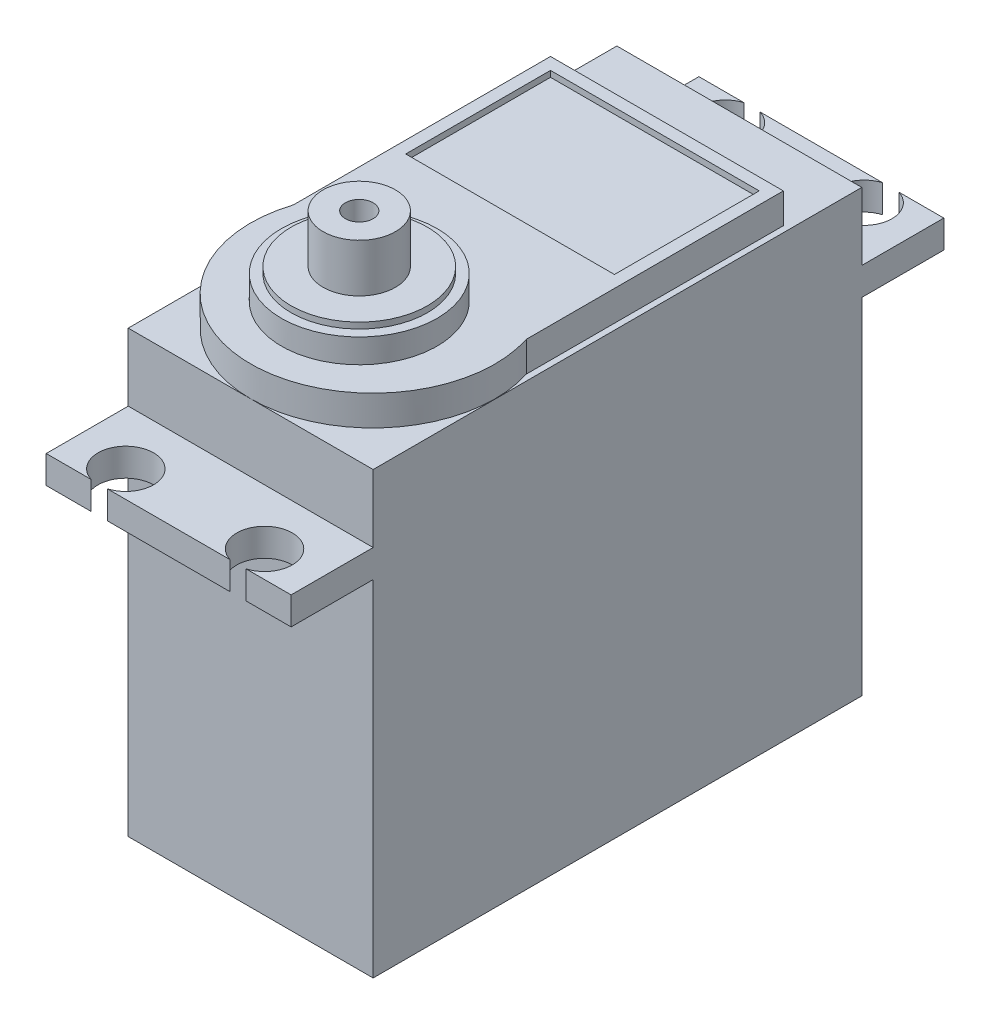
ISO-10303-21;
HEADER;
FILE_DESCRIPTION(('STEP AP214'),'2;1');
FILE_NAME('part.step','',(''),(''),'','','');
FILE_SCHEMA(('AUTOMOTIVE_DESIGN { 1 0 10303 214 1 1 1 1 }'));
ENDSEC;
DATA;
#1=APPLICATION_CONTEXT('core data for automotive mechanical design processes');
#2=APPLICATION_PROTOCOL_DEFINITION('international standard','automotive_design',2000,#1);
#3=PRODUCT_CONTEXT('',#1,'mechanical');
#4=PRODUCT('Part','Part','',(#3));
#5=PRODUCT_RELATED_PRODUCT_CATEGORY('part','',(#4));
#6=PRODUCT_DEFINITION_FORMATION('','',#4);
#7=PRODUCT_DEFINITION_CONTEXT('part definition',#1,'design');
#8=PRODUCT_DEFINITION('design','',#6,#7);
#9=PRODUCT_DEFINITION_SHAPE('','',#8);
#10=(LENGTH_UNIT() NAMED_UNIT(*) SI_UNIT(.MILLI.,.METRE.));
#11=(NAMED_UNIT(*) PLANE_ANGLE_UNIT() SI_UNIT($,.RADIAN.));
#12=(NAMED_UNIT(*) SI_UNIT($,.STERADIAN.) SOLID_ANGLE_UNIT());
#13=UNCERTAINTY_MEASURE_WITH_UNIT(LENGTH_MEASURE(1.E-05),#10,'distance_accuracy_value','');
#14=(GEOMETRIC_REPRESENTATION_CONTEXT(3) GLOBAL_UNCERTAINTY_ASSIGNED_CONTEXT((#13)) GLOBAL_UNIT_ASSIGNED_CONTEXT((#10,
#11,#12)) REPRESENTATION_CONTEXT('',''));
#15=CARTESIAN_POINT('',(0.,0.,0.));
#16=DIRECTION('',(0.,0.,1.));
#17=DIRECTION('',(1.,0.,0.));
#18=AXIS2_PLACEMENT_3D('',#15,#16,#17);
#19=CARTESIAN_POINT('',(-10.15,30.9,-27.05));
#20=DIRECTION('',(0.,-1.,0.));
#21=DIRECTION('',(0.,0.,-1.));
#22=AXIS2_PLACEMENT_3D('',#19,#20,#21);
#23=PLANE('',#22);
#24=DIRECTION('',(1.,0.,0.));
#25=VECTOR('',#24,1.);
#26=CARTESIAN_POINT('',(-10.15,30.9,-27.05));
#27=LINE('',#26,#25);
#28=CARTESIAN_POINT('',(-5.07917960675002,30.9,-27.05));
#29=VERTEX_POINT('',#28);
#30=CARTESIAN_POINT('',(5.07917960675007,30.9,-27.05));
#31=VERTEX_POINT('',#30);
#32=EDGE_CURVE('E351',#29,#31,#27,.T.);
#33=ORIENTED_EDGE('',*,*,#32,.F.);
#34=CARTESIAN_POINT('',(-5.74999999999999,30.9,-24.85));
#35=DIRECTION('',(0.,-1.,0.));
#36=DIRECTION('',(0.,0.,-1.));
#37=AXIS2_PLACEMENT_3D('',#34,#35,#36);
#38=CIRCLE('',#37,2.3);
#39=CARTESIAN_POINT('',(-6.42082039324996,30.9,-27.05));
#40=VERTEX_POINT('',#39);
#41=EDGE_CURVE('E315',#40,#29,#38,.F.);
#42=ORIENTED_EDGE('',*,*,#41,.F.);
#43=CARTESIAN_POINT('',(-10.15,30.9,-27.05));
#44=VERTEX_POINT('',#43);
#45=EDGE_CURVE('E347',#44,#40,#27,.T.);
#46=ORIENTED_EDGE('',*,*,#45,.F.);
#47=DIRECTION('',(0.,0.,1.));
#48=VECTOR('',#47,1.);
#49=CARTESIAN_POINT('',(-10.15,30.9,-27.05));
#50=LINE('',#49,#48);
#51=CARTESIAN_POINT('',(-10.15,30.9,-20.25));
#52=VERTEX_POINT('',#51);
#53=EDGE_CURVE('E356',#44,#52,#50,.T.);
#54=ORIENTED_EDGE('',*,*,#53,.T.);
#55=DIRECTION('',(1.,0.,0.));
#56=VECTOR('',#55,1.);
#57=CARTESIAN_POINT('',(-10.15,30.9,-20.25));
#58=LINE('',#57,#56);
#59=CARTESIAN_POINT('',(10.15,30.9,-20.25));
#60=VERTEX_POINT('',#59);
#61=EDGE_CURVE('E339',#52,#60,#58,.T.);
#62=ORIENTED_EDGE('',*,*,#61,.T.);
#63=DIRECTION('',(0.,0.,1.));
#64=VECTOR('',#63,1.);
#65=CARTESIAN_POINT('',(10.15,30.9,-27.05));
#66=LINE('',#65,#64);
#67=CARTESIAN_POINT('',(10.15,30.9,-27.05));
#68=VERTEX_POINT('',#67);
#69=EDGE_CURVE('E360',#68,#60,#66,.T.);
#70=ORIENTED_EDGE('',*,*,#69,.F.);
#71=CARTESIAN_POINT('',(6.42082039324993,30.9,-27.05));
#72=VERTEX_POINT('',#71);
#73=EDGE_CURVE('E346',#72,#68,#27,.T.);
#74=ORIENTED_EDGE('',*,*,#73,.F.);
#75=CARTESIAN_POINT('',(5.75,30.9,-24.85));
#76=DIRECTION('',(0.,-1.,0.));
#77=DIRECTION('',(0.,0.,-1.));
#78=AXIS2_PLACEMENT_3D('',#75,#76,#77);
#79=CIRCLE('',#78,2.3);
#80=EDGE_CURVE('E322',#72,#31,#79,.T.);
#81=ORIENTED_EDGE('',*,*,#80,.T.);
#82=EDGE_LOOP('',(#33,#42,#46,#54,#62,#70,#74,#81));
#83=FACE_BOUND('',#82,.T.);
#84=ADVANCED_FACE('F38',(#83),#23,.F.);
#85=CARTESIAN_POINT('',(10.15,28.6,-27.05));
#86=DIRECTION('',(0.,1.,0.));
#87=DIRECTION('',(0.,0.,1.));
#88=AXIS2_PLACEMENT_3D('',#85,#86,#87);
#89=PLANE('',#88);
#90=DIRECTION('',(-1.,0.,0.));
#91=VECTOR('',#90,1.);
#92=CARTESIAN_POINT('',(10.15,28.6,-27.05));
#93=LINE('',#92,#91);
#94=CARTESIAN_POINT('',(-6.42082039324996,28.6,-27.05));
#95=VERTEX_POINT('',#94);
#96=CARTESIAN_POINT('',(-10.15,28.6,-27.05));
#97=VERTEX_POINT('',#96);
#98=EDGE_CURVE('E338',#95,#97,#93,.T.);
#99=ORIENTED_EDGE('',*,*,#98,.F.);
#100=CARTESIAN_POINT('',(-5.74999999999999,28.6,-24.85));
#101=DIRECTION('',(0.,1.,0.));
#102=DIRECTION('',(0.,0.,1.));
#103=AXIS2_PLACEMENT_3D('',#100,#101,#102);
#104=CIRCLE('',#103,2.3);
#105=CARTESIAN_POINT('',(-5.07917960675002,28.6,-27.05));
#106=VERTEX_POINT('',#105);
#107=EDGE_CURVE('E319',#106,#95,#104,.F.);
#108=ORIENTED_EDGE('',*,*,#107,.F.);
#109=CARTESIAN_POINT('',(5.07917960675007,28.6,-27.05));
#110=VERTEX_POINT('',#109);
#111=EDGE_CURVE('E344',#110,#106,#93,.T.);
#112=ORIENTED_EDGE('',*,*,#111,.F.);
#113=CARTESIAN_POINT('',(5.75,28.6,-24.85));
#114=DIRECTION('',(0.,1.,0.));
#115=DIRECTION('',(0.,0.,1.));
#116=AXIS2_PLACEMENT_3D('',#113,#114,#115);
#117=CIRCLE('',#116,2.3);
#118=CARTESIAN_POINT('',(6.42082039324993,28.6,-27.05));
#119=VERTEX_POINT('',#118);
#120=EDGE_CURVE('E307',#110,#119,#117,.T.);
#121=ORIENTED_EDGE('',*,*,#120,.T.);
#122=CARTESIAN_POINT('',(10.15,28.6,-27.05));
#123=VERTEX_POINT('',#122);
#124=EDGE_CURVE('E340',#123,#119,#93,.T.);
#125=ORIENTED_EDGE('',*,*,#124,.F.);
#126=DIRECTION('',(0.,0.,1.));
#127=VECTOR('',#126,1.);
#128=CARTESIAN_POINT('',(10.15,28.6,-27.05));
#129=LINE('',#128,#127);
#130=CARTESIAN_POINT('',(10.15,28.6,-20.25));
#131=VERTEX_POINT('',#130);
#132=EDGE_CURVE('E363',#123,#131,#129,.T.);
#133=ORIENTED_EDGE('',*,*,#132,.T.);
#134=DIRECTION('',(-1.,0.,0.));
#135=VECTOR('',#134,1.);
#136=CARTESIAN_POINT('',(10.15,28.6,-20.25));
#137=LINE('',#136,#135);
#138=CARTESIAN_POINT('',(-10.15,28.6,-20.25));
#139=VERTEX_POINT('',#138);
#140=EDGE_CURVE('E317',#131,#139,#137,.T.);
#141=ORIENTED_EDGE('',*,*,#140,.T.);
#142=DIRECTION('',(0.,0.,1.));
#143=VECTOR('',#142,1.);
#144=CARTESIAN_POINT('',(-10.15,28.6,-27.05));
#145=LINE('',#144,#143);
#146=EDGE_CURVE('E350',#97,#139,#145,.T.);
#147=ORIENTED_EDGE('',*,*,#146,.F.);
#148=EDGE_LOOP('',(#99,#108,#112,#121,#125,#133,#141,#147));
#149=FACE_BOUND('',#148,.T.);
#150=ADVANCED_FACE('F478',(#149),#89,.F.);
#151=CARTESIAN_POINT('',(0.,0.,-27.05));
#152=DIRECTION('',(0.,0.,1.));
#153=DIRECTION('',(-1.,0.,0.));
#154=AXIS2_PLACEMENT_3D('',#151,#152,#153);
#155=PLANE('',#154);
#156=ORIENTED_EDGE('',*,*,#111,.T.);
#157=DIRECTION('',(0.,1.,0.));
#158=VECTOR('',#157,1.);
#159=CARTESIAN_POINT('',(-5.07917960675002,-0.00199999999999853,-27.05));
#160=LINE('',#159,#158);
#161=EDGE_CURVE('E321',#106,#29,#160,.T.);
#162=ORIENTED_EDGE('',*,*,#161,.T.);
#163=ORIENTED_EDGE('',*,*,#32,.T.);
#164=DIRECTION('',(0.,1.,0.));
#165=VECTOR('',#164,1.);
#166=CARTESIAN_POINT('',(5.07917960675007,-0.00199999999999853,-27.05));
#167=LINE('',#166,#165);
#168=EDGE_CURVE('E331',#110,#31,#167,.T.);
#169=ORIENTED_EDGE('',*,*,#168,.F.);
#170=EDGE_LOOP('',(#156,#162,#163,#169));
#171=FACE_BOUND('',#170,.T.);
#172=ADVANCED_FACE('F543',(#171),#155,.F.);
#173=DIRECTION('',(0.,1.,0.));
#174=VECTOR('',#173,1.);
#175=CARTESIAN_POINT('',(6.42082039324993,-0.00199999999999853,-27.05));
#176=LINE('',#175,#174);
#177=EDGE_CURVE('E328',#119,#72,#176,.T.);
#178=ORIENTED_EDGE('',*,*,#177,.T.);
#179=ORIENTED_EDGE('',*,*,#73,.T.);
#180=DIRECTION('',(0.,-1.,0.));
#181=VECTOR('',#180,1.);
#182=CARTESIAN_POINT('',(10.15,30.9,-27.05));
#183=LINE('',#182,#181);
#184=EDGE_CURVE('E343',#68,#123,#183,.T.);
#185=ORIENTED_EDGE('',*,*,#184,.T.);
#186=ORIENTED_EDGE('',*,*,#124,.T.);
#187=EDGE_LOOP('',(#178,#179,#185,#186));
#188=FACE_BOUND('',#187,.T.);
#189=ADVANCED_FACE('F483',(#188),#155,.F.);
#190=ORIENTED_EDGE('',*,*,#45,.T.);
#191=DIRECTION('',(0.,1.,0.));
#192=VECTOR('',#191,1.);
#193=CARTESIAN_POINT('',(-6.42082039324996,-0.00199999999999853,-27.05));
#194=LINE('',#193,#192);
#195=EDGE_CURVE('E318',#95,#40,#194,.T.);
#196=ORIENTED_EDGE('',*,*,#195,.F.);
#197=ORIENTED_EDGE('',*,*,#98,.T.);
#198=DIRECTION('',(0.,1.,0.));
#199=VECTOR('',#198,1.);
#200=CARTESIAN_POINT('',(-10.15,28.6,-27.05));
#201=LINE('',#200,#199);
#202=EDGE_CURVE('E335',#97,#44,#201,.T.);
#203=ORIENTED_EDGE('',*,*,#202,.T.);
#204=EDGE_LOOP('',(#190,#196,#197,#203));
#205=FACE_BOUND('',#204,.T.);
#206=ADVANCED_FACE('F809',(#205),#155,.F.);
#207=CARTESIAN_POINT('',(-10.15,36.5,-20.25));
#208=DIRECTION('',(0.,0.,1.));
#209=DIRECTION('',(1.,0.,0.));
#210=AXIS2_PLACEMENT_3D('',#207,#208,#209);
#211=PLANE('',#210);
#212=ORIENTED_EDGE('',*,*,#140,.F.);
#213=DIRECTION('',(0.,-1.,0.));
#214=VECTOR('',#213,1.);
#215=CARTESIAN_POINT('',(10.15,36.5,-20.25));
#216=LINE('',#215,#214);
#217=CARTESIAN_POINT('',(10.15,0.,-20.25));
#218=VERTEX_POINT('',#217);
#219=EDGE_CURVE('E451',#131,#218,#216,.T.);
#220=ORIENTED_EDGE('',*,*,#219,.T.);
#221=DIRECTION('',(-1.,0.,0.));
#222=VECTOR('',#221,1.);
#223=CARTESIAN_POINT('',(-10.15,0.,-20.25));
#224=LINE('',#223,#222);
#225=CARTESIAN_POINT('',(-10.15,0.,-20.25));
#226=VERTEX_POINT('',#225);
#227=EDGE_CURVE('E433',#218,#226,#224,.T.);
#228=ORIENTED_EDGE('',*,*,#227,.T.);
#229=DIRECTION('',(0.,-1.,0.));
#230=VECTOR('',#229,1.);
#231=CARTESIAN_POINT('',(-10.15,36.5,-20.25));
#232=LINE('',#231,#230);
#233=EDGE_CURVE('E448',#139,#226,#232,.T.);
#234=ORIENTED_EDGE('',*,*,#233,.F.);
#235=EDGE_LOOP('',(#212,#220,#228,#234));
#236=FACE_BOUND('',#235,.T.);
#237=ADVANCED_FACE('F458',(#236),#211,.F.);
#238=ORIENTED_EDGE('',*,*,#61,.F.);
#239=CARTESIAN_POINT('',(-10.15,36.5,-20.25));
#240=VERTEX_POINT('',#239);
#241=EDGE_CURVE('E449',#240,#52,#232,.T.);
#242=ORIENTED_EDGE('',*,*,#241,.F.);
#243=DIRECTION('',(-1.,0.,0.));
#244=VECTOR('',#243,1.);
#245=CARTESIAN_POINT('',(-10.15,36.5,-20.25));
#246=LINE('',#245,#244);
#247=CARTESIAN_POINT('',(10.15,36.5,-20.25));
#248=VERTEX_POINT('',#247);
#249=EDGE_CURVE('E421',#248,#240,#246,.T.);
#250=ORIENTED_EDGE('',*,*,#249,.F.);
#251=EDGE_CURVE('E452',#248,#60,#216,.T.);
#252=ORIENTED_EDGE('',*,*,#251,.T.);
#253=EDGE_LOOP('',(#238,#242,#250,#252));
#254=FACE_BOUND('',#253,.T.);
#255=ADVANCED_FACE('F489',(#254),#211,.F.);
#256=CARTESIAN_POINT('',(10.15,28.6,27.05));
#257=DIRECTION('',(0.,-1.,0.));
#258=DIRECTION('',(0.,0.,-1.));
#259=AXIS2_PLACEMENT_3D('',#256,#257,#258);
#260=PLANE('',#259);
#261=DIRECTION('',(-1.,0.,0.));
#262=VECTOR('',#261,1.);
#263=CARTESIAN_POINT('',(10.15,28.6,27.05));
#264=LINE('',#263,#262);
#265=CARTESIAN_POINT('',(5.07917960675007,28.6,27.05));
#266=VERTEX_POINT('',#265);
#267=CARTESIAN_POINT('',(-5.07917960675003,28.6,27.05));
#268=VERTEX_POINT('',#267);
#269=EDGE_CURVE('E405',#266,#268,#264,.T.);
#270=ORIENTED_EDGE('',*,*,#269,.T.);
#271=CARTESIAN_POINT('',(-5.74999999999999,28.6,24.85));
#272=DIRECTION('',(0.,-1.,0.));
#273=DIRECTION('',(0.,0.,-1.));
#274=AXIS2_PLACEMENT_3D('',#271,#272,#273);
#275=CIRCLE('',#274,2.3);
#276=CARTESIAN_POINT('',(-6.42082039324996,28.6,27.05));
#277=VERTEX_POINT('',#276);
#278=EDGE_CURVE('E373',#277,#268,#275,.T.);
#279=ORIENTED_EDGE('',*,*,#278,.F.);
#280=CARTESIAN_POINT('',(-10.15,28.6,27.05));
#281=VERTEX_POINT('',#280);
#282=EDGE_CURVE('E400',#277,#281,#264,.T.);
#283=ORIENTED_EDGE('',*,*,#282,.T.);
#284=DIRECTION('',(0.,0.,-1.));
#285=VECTOR('',#284,1.);
#286=CARTESIAN_POINT('',(-10.15,28.6,27.05));
#287=LINE('',#286,#285);
#288=CARTESIAN_POINT('',(-10.15,28.6,20.25));
#289=VERTEX_POINT('',#288);
#290=EDGE_CURVE('E410',#281,#289,#287,.T.);
#291=ORIENTED_EDGE('',*,*,#290,.T.);
#292=DIRECTION('',(-1.,0.,0.));
#293=VECTOR('',#292,1.);
#294=CARTESIAN_POINT('',(10.15,28.6,20.25));
#295=LINE('',#294,#293);
#296=CARTESIAN_POINT('',(10.15,28.6,20.25));
#297=VERTEX_POINT('',#296);
#298=EDGE_CURVE('E392',#297,#289,#295,.T.);
#299=ORIENTED_EDGE('',*,*,#298,.F.);
#300=DIRECTION('',(0.,0.,-1.));
#301=VECTOR('',#300,1.);
#302=CARTESIAN_POINT('',(10.15,28.6,27.05));
#303=LINE('',#302,#301);
#304=CARTESIAN_POINT('',(10.15,28.6,27.05));
#305=VERTEX_POINT('',#304);
#306=EDGE_CURVE('E413',#305,#297,#303,.T.);
#307=ORIENTED_EDGE('',*,*,#306,.F.);
#308=CARTESIAN_POINT('',(6.42082039324993,28.6,27.05));
#309=VERTEX_POINT('',#308);
#310=EDGE_CURVE('E401',#305,#309,#264,.T.);
#311=ORIENTED_EDGE('',*,*,#310,.T.);
#312=CARTESIAN_POINT('',(5.75,28.6,24.85));
#313=DIRECTION('',(0.,-1.,0.));
#314=DIRECTION('',(0.,0.,-1.));
#315=AXIS2_PLACEMENT_3D('',#312,#313,#314);
#316=CIRCLE('',#315,2.3);
#317=EDGE_CURVE('E359',#309,#266,#316,.F.);
#318=ORIENTED_EDGE('',*,*,#317,.T.);
#319=EDGE_LOOP('',(#270,#279,#283,#291,#299,#307,#311,#318));
#320=FACE_BOUND('',#319,.T.);
#321=ADVANCED_FACE('F520',(#320),#260,.T.);
#322=CARTESIAN_POINT('',(-10.15,30.9,27.05));
#323=DIRECTION('',(0.,1.,0.));
#324=DIRECTION('',(0.,0.,1.));
#325=AXIS2_PLACEMENT_3D('',#322,#323,#324);
#326=PLANE('',#325);
#327=DIRECTION('',(1.,0.,0.));
#328=VECTOR('',#327,1.);
#329=CARTESIAN_POINT('',(-10.15,30.9,27.05));
#330=LINE('',#329,#328);
#331=CARTESIAN_POINT('',(-10.15,30.9,27.05));
#332=VERTEX_POINT('',#331);
#333=CARTESIAN_POINT('',(-6.42082039324996,30.9,27.05));
#334=VERTEX_POINT('',#333);
#335=EDGE_CURVE('E393',#332,#334,#330,.T.);
#336=ORIENTED_EDGE('',*,*,#335,.T.);
#337=CARTESIAN_POINT('',(-5.74999999999999,30.9,24.85));
#338=DIRECTION('',(0.,1.,0.));
#339=DIRECTION('',(0.,0.,1.));
#340=AXIS2_PLACEMENT_3D('',#337,#338,#339);
#341=CIRCLE('',#340,2.3);
#342=CARTESIAN_POINT('',(-5.07917960675002,30.9,27.05));
#343=VERTEX_POINT('',#342);
#344=EDGE_CURVE('E368',#334,#343,#341,.F.);
#345=ORIENTED_EDGE('',*,*,#344,.T.);
#346=CARTESIAN_POINT('',(5.07917960675007,30.9,27.05));
#347=VERTEX_POINT('',#346);
#348=EDGE_CURVE('E397',#343,#347,#330,.T.);
#349=ORIENTED_EDGE('',*,*,#348,.T.);
#350=CARTESIAN_POINT('',(5.75,30.9,24.85));
#351=DIRECTION('',(0.,1.,0.));
#352=DIRECTION('',(0.,0.,1.));
#353=AXIS2_PLACEMENT_3D('',#350,#351,#352);
#354=CIRCLE('',#353,2.3);
#355=CARTESIAN_POINT('',(6.42082039324993,30.9,27.05));
#356=VERTEX_POINT('',#355);
#357=EDGE_CURVE('E376',#356,#347,#354,.T.);
#358=ORIENTED_EDGE('',*,*,#357,.F.);
#359=CARTESIAN_POINT('',(10.15,30.9,27.05));
#360=VERTEX_POINT('',#359);
#361=EDGE_CURVE('E391',#356,#360,#330,.T.);
#362=ORIENTED_EDGE('',*,*,#361,.T.);
#363=DIRECTION('',(0.,0.,-1.));
#364=VECTOR('',#363,1.);
#365=CARTESIAN_POINT('',(10.15,30.9,27.05));
#366=LINE('',#365,#364);
#367=CARTESIAN_POINT('',(10.15,30.9,20.25));
#368=VERTEX_POINT('',#367);
#369=EDGE_CURVE('E415',#360,#368,#366,.T.);
#370=ORIENTED_EDGE('',*,*,#369,.T.);
#371=DIRECTION('',(1.,0.,0.));
#372=VECTOR('',#371,1.);
#373=CARTESIAN_POINT('',(-10.15,30.9,20.25));
#374=LINE('',#373,#372);
#375=CARTESIAN_POINT('',(-10.15,30.9,20.25));
#376=VERTEX_POINT('',#375);
#377=EDGE_CURVE('E371',#376,#368,#374,.T.);
#378=ORIENTED_EDGE('',*,*,#377,.F.);
#379=DIRECTION('',(0.,0.,-1.));
#380=VECTOR('',#379,1.);
#381=CARTESIAN_POINT('',(-10.15,30.9,27.05));
#382=LINE('',#381,#380);
#383=EDGE_CURVE('E404',#332,#376,#382,.T.);
#384=ORIENTED_EDGE('',*,*,#383,.F.);
#385=EDGE_LOOP('',(#336,#345,#349,#358,#362,#370,#378,#384));
#386=FACE_BOUND('',#385,.T.);
#387=ADVANCED_FACE('F504',(#386),#326,.T.);
#388=CARTESIAN_POINT('',(0.,0.,27.05));
#389=DIRECTION('',(0.,0.,-1.));
#390=DIRECTION('',(-1.,0.,0.));
#391=AXIS2_PLACEMENT_3D('',#388,#389,#390);
#392=PLANE('',#391);
#393=DIRECTION('',(0.,1.,0.));
#394=VECTOR('',#393,1.);
#395=CARTESIAN_POINT('',(-6.42082039324996,-0.00199999999999853,27.05));
#396=LINE('',#395,#394);
#397=EDGE_CURVE('E375',#277,#334,#396,.T.);
#398=ORIENTED_EDGE('',*,*,#397,.T.);
#399=ORIENTED_EDGE('',*,*,#335,.F.);
#400=DIRECTION('',(0.,1.,0.));
#401=VECTOR('',#400,1.);
#402=CARTESIAN_POINT('',(-10.15,28.6,27.05));
#403=LINE('',#402,#401);
#404=EDGE_CURVE('E388',#281,#332,#403,.T.);
#405=ORIENTED_EDGE('',*,*,#404,.F.);
#406=ORIENTED_EDGE('',*,*,#282,.F.);
#407=EDGE_LOOP('',(#398,#399,#405,#406));
#408=FACE_BOUND('',#407,.T.);
#409=ADVANCED_FACE('F526',(#408),#392,.F.);
#410=DIRECTION('',(0.,1.,0.));
#411=VECTOR('',#410,1.);
#412=CARTESIAN_POINT('',(-5.07917960675002,-0.00199999999999853,27.05));
#413=LINE('',#412,#411);
#414=EDGE_CURVE('E372',#268,#343,#413,.T.);
#415=ORIENTED_EDGE('',*,*,#414,.F.);
#416=ORIENTED_EDGE('',*,*,#269,.F.);
#417=DIRECTION('',(0.,1.,0.));
#418=VECTOR('',#417,1.);
#419=CARTESIAN_POINT('',(5.07917960675007,-0.00199999999999853,27.05));
#420=LINE('',#419,#418);
#421=EDGE_CURVE('E381',#266,#347,#420,.T.);
#422=ORIENTED_EDGE('',*,*,#421,.T.);
#423=ORIENTED_EDGE('',*,*,#348,.F.);
#424=EDGE_LOOP('',(#415,#416,#422,#423));
#425=FACE_BOUND('',#424,.T.);
#426=ADVANCED_FACE('F514',(#425),#392,.F.);
#427=CARTESIAN_POINT('',(-10.15,36.5,20.25));
#428=DIRECTION('',(0.,0.,-1.));
#429=DIRECTION('',(-1.,0.,0.));
#430=AXIS2_PLACEMENT_3D('',#427,#428,#429);
#431=PLANE('',#430);
#432=DIRECTION('',(0.,-1.,0.));
#433=VECTOR('',#432,1.);
#434=CARTESIAN_POINT('',(-10.15,36.5,20.25));
#435=LINE('',#434,#433);
#436=CARTESIAN_POINT('',(-10.15,36.5,20.25));
#437=VERTEX_POINT('',#436);
#438=EDGE_CURVE('E445',#437,#376,#435,.T.);
#439=ORIENTED_EDGE('',*,*,#438,.T.);
#440=ORIENTED_EDGE('',*,*,#377,.T.);
#441=DIRECTION('',(0.,-1.,0.));
#442=VECTOR('',#441,1.);
#443=CARTESIAN_POINT('',(10.15,36.5,20.25));
#444=LINE('',#443,#442);
#445=CARTESIAN_POINT('',(10.15,36.5,20.25));
#446=VERTEX_POINT('',#445);
#447=EDGE_CURVE('E441',#446,#368,#444,.T.);
#448=ORIENTED_EDGE('',*,*,#447,.F.);
#449=DIRECTION('',(1.,0.,0.));
#450=VECTOR('',#449,1.);
#451=CARTESIAN_POINT('',(-10.15,36.5,20.25));
#452=LINE('',#451,#450);
#453=CARTESIAN_POINT('',(0.,36.5,20.25));
#454=VERTEX_POINT('',#453);
#455=EDGE_CURVE('E426',#454,#446,#452,.T.);
#456=ORIENTED_EDGE('',*,*,#455,.F.);
#457=EDGE_CURVE('E427',#437,#454,#452,.T.);
#458=ORIENTED_EDGE('',*,*,#457,.F.);
#459=EDGE_LOOP('',(#439,#440,#448,#456,#458));
#460=FACE_BOUND('',#459,.T.);
#461=ADVANCED_FACE('F501',(#460),#431,.F.);
#462=CARTESIAN_POINT('',(10.15,36.5,20.25));
#463=DIRECTION('',(-1.,0.,0.));
#464=DIRECTION('',(0.,0.,1.));
#465=AXIS2_PLACEMENT_3D('',#462,#463,#464);
#466=PLANE('',#465);
#467=DIRECTION('',(0.,0.,-1.));
#468=VECTOR('',#467,1.);
#469=CARTESIAN_POINT('',(10.15,0.,20.25));
#470=LINE('',#469,#468);
#471=CARTESIAN_POINT('',(10.15,0.,20.25));
#472=VERTEX_POINT('',#471);
#473=EDGE_CURVE('E412',#472,#218,#470,.T.);
#474=ORIENTED_EDGE('',*,*,#473,.T.);
#475=ORIENTED_EDGE('',*,*,#219,.F.);
#476=ORIENTED_EDGE('',*,*,#132,.F.);
#477=ORIENTED_EDGE('',*,*,#184,.F.);
#478=ORIENTED_EDGE('',*,*,#69,.T.);
#479=ORIENTED_EDGE('',*,*,#251,.F.);
#480=DIRECTION('',(0.,0.,-1.));
#481=VECTOR('',#480,1.);
#482=CARTESIAN_POINT('',(10.15,36.5,20.25));
#483=LINE('',#482,#481);
#484=EDGE_CURVE('E418',#446,#248,#483,.T.);
#485=ORIENTED_EDGE('',*,*,#484,.F.);
#486=ORIENTED_EDGE('',*,*,#447,.T.);
#487=ORIENTED_EDGE('',*,*,#369,.F.);
#488=DIRECTION('',(0.,-1.,0.));
#489=VECTOR('',#488,1.);
#490=CARTESIAN_POINT('',(10.15,30.9,27.05));
#491=LINE('',#490,#489);
#492=EDGE_CURVE('E396',#360,#305,#491,.T.);
#493=ORIENTED_EDGE('',*,*,#492,.T.);
#494=ORIENTED_EDGE('',*,*,#306,.T.);
#495=EDGE_CURVE('E430',#297,#472,#444,.T.);
#496=ORIENTED_EDGE('',*,*,#495,.T.);
#497=EDGE_LOOP('',(#474,#475,#476,#477,#478,#479,#485,#486,#487,#493,#494,#496));
#498=FACE_BOUND('',#497,.T.);
#499=ADVANCED_FACE('F40',(#498),#466,.F.);
#500=CARTESIAN_POINT('',(-10.15,36.5,20.25));
#501=DIRECTION('',(1.,0.,0.));
#502=DIRECTION('',(0.,0.,-1.));
#503=AXIS2_PLACEMENT_3D('',#500,#501,#502);
#504=PLANE('',#503);
#505=DIRECTION('',(0.,0.,1.));
#506=VECTOR('',#505,1.);
#507=CARTESIAN_POINT('',(-10.15,0.,20.25));
#508=LINE('',#507,#506);
#509=CARTESIAN_POINT('',(-10.15,0.,20.25));
#510=VERTEX_POINT('',#509);
#511=EDGE_CURVE('E436',#226,#510,#508,.T.);
#512=ORIENTED_EDGE('',*,*,#511,.T.);
#513=EDGE_CURVE('E444',#289,#510,#435,.T.);
#514=ORIENTED_EDGE('',*,*,#513,.F.);
#515=ORIENTED_EDGE('',*,*,#290,.F.);
#516=ORIENTED_EDGE('',*,*,#404,.T.);
#517=ORIENTED_EDGE('',*,*,#383,.T.);
#518=ORIENTED_EDGE('',*,*,#438,.F.);
#519=DIRECTION('',(0.,0.,1.));
#520=VECTOR('',#519,1.);
#521=CARTESIAN_POINT('',(-10.15,36.5,20.25));
#522=LINE('',#521,#520);
#523=EDGE_CURVE('E424',#240,#437,#522,.T.);
#524=ORIENTED_EDGE('',*,*,#523,.F.);
#525=ORIENTED_EDGE('',*,*,#241,.T.);
#526=ORIENTED_EDGE('',*,*,#53,.F.);
#527=ORIENTED_EDGE('',*,*,#202,.F.);
#528=ORIENTED_EDGE('',*,*,#146,.T.);
#529=ORIENTED_EDGE('',*,*,#233,.T.);
#530=EDGE_LOOP('',(#512,#514,#515,#516,#517,#518,#524,#525,#526,#527,#528,#529));
#531=FACE_BOUND('',#530,.T.);
#532=ADVANCED_FACE('F473',(#531),#504,.F.);
#533=ORIENTED_EDGE('',*,*,#495,.F.);
#534=ORIENTED_EDGE('',*,*,#298,.T.);
#535=ORIENTED_EDGE('',*,*,#513,.T.);
#536=DIRECTION('',(1.,0.,0.));
#537=VECTOR('',#536,1.);
#538=CARTESIAN_POINT('',(-10.15,0.,20.25));
#539=LINE('',#538,#537);
#540=EDGE_CURVE('E422',#510,#472,#539,.T.);
#541=ORIENTED_EDGE('',*,*,#540,.T.);
#542=EDGE_LOOP('',(#533,#534,#535,#541));
#543=FACE_BOUND('',#542,.T.);
#544=ADVANCED_FACE('F469',(#543),#431,.F.);
#545=CARTESIAN_POINT('',(0.,36.5,0.));
#546=DIRECTION('',(0.,-1.,0.));
#547=DIRECTION('',(0.,0.,-1.));
#548=AXIS2_PLACEMENT_3D('',#545,#546,#547);
#549=PLANE('',#548);
#550=DIRECTION('',(-1.,0.,0.));
#551=VECTOR('',#550,1.);
#552=CARTESIAN_POINT('',(9.65,36.5,-14.25));
#553=LINE('',#552,#551);
#554=CARTESIAN_POINT('',(9.65,36.5,-14.25));
#555=VERTEX_POINT('',#554);
#556=CARTESIAN_POINT('',(-9.65,36.5,-14.25));
#557=VERTEX_POINT('',#556);
#558=EDGE_CURVE('E287',#555,#557,#553,.T.);
#559=ORIENTED_EDGE('',*,*,#558,.F.);
#560=DIRECTION('',(0.,0.,1.));
#561=VECTOR('',#560,1.);
#562=CARTESIAN_POINT('',(9.65,36.5,-14.25));
#563=LINE('',#562,#561);
#564=CARTESIAN_POINT('',(9.65,36.5,7.05));
#565=VERTEX_POINT('',#564);
#566=EDGE_CURVE('E63',#555,#565,#563,.T.);
#567=ORIENTED_EDGE('',*,*,#566,.T.);
#568=CARTESIAN_POINT('',(0.,36.5,10.1226325757576));
#569=DIRECTION('',(0.,-1.,0.));
#570=DIRECTION('',(0.,0.,-1.));
#571=AXIS2_PLACEMENT_3D('',#568,#569,#570);
#572=CIRCLE('',#571,10.1273674242424);
#573=EDGE_CURVE('E296',#565,#454,#572,.T.);
#574=ORIENTED_EDGE('',*,*,#573,.T.);
#575=ORIENTED_EDGE('',*,*,#455,.T.);
#576=ORIENTED_EDGE('',*,*,#484,.T.);
#577=ORIENTED_EDGE('',*,*,#249,.T.);
#578=ORIENTED_EDGE('',*,*,#523,.T.);
#579=ORIENTED_EDGE('',*,*,#457,.T.);
#580=CARTESIAN_POINT('',(-9.65,36.5,7.05));
#581=VERTEX_POINT('',#580);
#582=EDGE_CURVE('E299',#454,#581,#572,.T.);
#583=ORIENTED_EDGE('',*,*,#582,.T.);
#584=DIRECTION('',(0.,0.,1.));
#585=VECTOR('',#584,1.);
#586=CARTESIAN_POINT('',(-9.65,36.5,-14.25));
#587=LINE('',#586,#585);
#588=EDGE_CURVE('E298',#557,#581,#587,.T.);
#589=ORIENTED_EDGE('',*,*,#588,.F.);
#590=EDGE_LOOP('',(#559,#567,#574,#575,#576,#577,#578,#579,#583,#589));
#591=FACE_BOUND('',#590,.T.);
#592=ADVANCED_FACE('F493',(#591),#549,.F.);
#593=CARTESIAN_POINT('',(0.,0.,0.));
#594=DIRECTION('',(0.,-1.,0.));
#595=DIRECTION('',(0.,0.,-1.));
#596=AXIS2_PLACEMENT_3D('',#593,#594,#595);
#597=PLANE('',#596);
#598=ORIENTED_EDGE('',*,*,#473,.F.);
#599=ORIENTED_EDGE('',*,*,#540,.F.);
#600=ORIENTED_EDGE('',*,*,#511,.F.);
#601=ORIENTED_EDGE('',*,*,#227,.F.);
#602=EDGE_LOOP('',(#598,#599,#600,#601));
#603=FACE_BOUND('',#602,.T.);
#604=ADVANCED_FACE('F464',(#603),#597,.T.);
#605=ORIENTED_EDGE('',*,*,#361,.F.);
#606=DIRECTION('',(0.,1.,0.));
#607=VECTOR('',#606,1.);
#608=CARTESIAN_POINT('',(6.42082039324993,-0.00199999999999853,27.05));
#609=LINE('',#608,#607);
#610=EDGE_CURVE('E384',#309,#356,#609,.T.);
#611=ORIENTED_EDGE('',*,*,#610,.F.);
#612=ORIENTED_EDGE('',*,*,#310,.F.);
#613=ORIENTED_EDGE('',*,*,#492,.F.);
#614=EDGE_LOOP('',(#605,#611,#612,#613));
#615=FACE_BOUND('',#614,.T.);
#616=ADVANCED_FACE('F523',(#615),#392,.F.);
#617=CARTESIAN_POINT('',(5.75,-0.00199999999999853,24.85));
#618=DIRECTION('',(0.,1.,0.));
#619=DIRECTION('',(0.,0.,1.));
#620=AXIS2_PLACEMENT_3D('',#617,#618,#619);
#621=CYLINDRICAL_SURFACE('',#620,2.3);
#622=ORIENTED_EDGE('',*,*,#610,.T.);
#623=ORIENTED_EDGE('',*,*,#357,.T.);
#624=ORIENTED_EDGE('',*,*,#421,.F.);
#625=ORIENTED_EDGE('',*,*,#317,.F.);
#626=EDGE_LOOP('',(#622,#623,#624,#625));
#627=FACE_BOUND('',#626,.T.);
#628=ADVANCED_FACE('F518',(#627),#621,.F.);
#629=CARTESIAN_POINT('',(-5.74999999999999,-0.00199999999999853,24.85));
#630=DIRECTION('',(0.,1.,0.));
#631=DIRECTION('',(0.,0.,1.));
#632=AXIS2_PLACEMENT_3D('',#629,#630,#631);
#633=CYLINDRICAL_SURFACE('',#632,2.3);
#634=ORIENTED_EDGE('',*,*,#278,.T.);
#635=ORIENTED_EDGE('',*,*,#414,.T.);
#636=ORIENTED_EDGE('',*,*,#344,.F.);
#637=ORIENTED_EDGE('',*,*,#397,.F.);
#638=EDGE_LOOP('',(#634,#635,#636,#637));
#639=FACE_BOUND('',#638,.T.);
#640=ADVANCED_FACE('F531',(#639),#633,.F.);
#641=CARTESIAN_POINT('',(5.75,-0.00199999999999853,-24.85));
#642=DIRECTION('',(0.,1.,0.));
#643=DIRECTION('',(0.,0.,1.));
#644=AXIS2_PLACEMENT_3D('',#641,#642,#643);
#645=CYLINDRICAL_SURFACE('',#644,2.3);
#646=ORIENTED_EDGE('',*,*,#168,.T.);
#647=ORIENTED_EDGE('',*,*,#80,.F.);
#648=ORIENTED_EDGE('',*,*,#177,.F.);
#649=ORIENTED_EDGE('',*,*,#120,.F.);
#650=EDGE_LOOP('',(#646,#647,#648,#649));
#651=FACE_BOUND('',#650,.T.);
#652=ADVANCED_FACE('F549',(#651),#645,.F.);
#653=CARTESIAN_POINT('',(-5.74999999999999,-0.00199999999999853,-24.85));
#654=DIRECTION('',(0.,1.,0.));
#655=DIRECTION('',(0.,0.,1.));
#656=AXIS2_PLACEMENT_3D('',#653,#654,#655);
#657=CYLINDRICAL_SURFACE('',#656,2.3);
#658=ORIENTED_EDGE('',*,*,#107,.T.);
#659=ORIENTED_EDGE('',*,*,#195,.T.);
#660=ORIENTED_EDGE('',*,*,#41,.T.);
#661=ORIENTED_EDGE('',*,*,#161,.F.);
#662=EDGE_LOOP('',(#658,#659,#660,#661));
#663=FACE_BOUND('',#662,.T.);
#664=ADVANCED_FACE('F554',(#663),#657,.F.);
#665=CARTESIAN_POINT('',(9.65,39.,-14.25));
#666=DIRECTION('',(1.,0.,0.));
#667=DIRECTION('',(0.,0.,-1.));
#668=AXIS2_PLACEMENT_3D('',#665,#666,#667);
#669=PLANE('',#668);
#670=ORIENTED_EDGE('',*,*,#566,.F.);
#671=DIRECTION('',(0.,-1.,0.));
#672=VECTOR('',#671,1.);
#673=CARTESIAN_POINT('',(9.65,39.,-14.25));
#674=LINE('',#673,#672);
#675=CARTESIAN_POINT('',(9.65,39.,-14.25));
#676=VERTEX_POINT('',#675);
#677=EDGE_CURVE('E304',#676,#555,#674,.T.);
#678=ORIENTED_EDGE('',*,*,#677,.F.);
#679=DIRECTION('',(0.,0.,1.));
#680=VECTOR('',#679,1.);
#681=CARTESIAN_POINT('',(9.65,39.,-14.25));
#682=LINE('',#681,#680);
#683=CARTESIAN_POINT('',(9.65,39.,7.05));
#684=VERTEX_POINT('',#683);
#685=EDGE_CURVE('E283',#676,#684,#682,.T.);
#686=ORIENTED_EDGE('',*,*,#685,.T.);
#687=DIRECTION('',(0.,-1.,0.));
#688=VECTOR('',#687,1.);
#689=CARTESIAN_POINT('',(9.65,39.,7.05));
#690=LINE('',#689,#688);
#691=EDGE_CURVE('E294',#684,#565,#690,.T.);
#692=ORIENTED_EDGE('',*,*,#691,.T.);
#693=EDGE_LOOP('',(#670,#678,#686,#692));
#694=FACE_BOUND('',#693,.T.);
#695=ADVANCED_FACE('F561',(#694),#669,.T.);
#696=CARTESIAN_POINT('',(9.65,39.,-14.25));
#697=DIRECTION('',(0.,0.,1.));
#698=DIRECTION('',(1.,0.,0.));
#699=AXIS2_PLACEMENT_3D('',#696,#697,#698);
#700=PLANE('',#699);
#701=ORIENTED_EDGE('',*,*,#558,.T.);
#702=DIRECTION('',(0.,-1.,0.));
#703=VECTOR('',#702,1.);
#704=CARTESIAN_POINT('',(-9.65,39.,-14.25));
#705=LINE('',#704,#703);
#706=CARTESIAN_POINT('',(-9.65,39.,-14.25));
#707=VERTEX_POINT('',#706);
#708=EDGE_CURVE('E308',#707,#557,#705,.T.);
#709=ORIENTED_EDGE('',*,*,#708,.F.);
#710=DIRECTION('',(-1.,0.,0.));
#711=VECTOR('',#710,1.);
#712=CARTESIAN_POINT('',(9.65,39.,-14.25));
#713=LINE('',#712,#711);
#714=EDGE_CURVE('E292',#676,#707,#713,.T.);
#715=ORIENTED_EDGE('',*,*,#714,.F.);
#716=ORIENTED_EDGE('',*,*,#677,.T.);
#717=EDGE_LOOP('',(#701,#709,#715,#716));
#718=FACE_BOUND('',#717,.T.);
#719=ADVANCED_FACE('F567',(#718),#700,.F.);
#720=CARTESIAN_POINT('',(-9.65,39.,-14.25));
#721=DIRECTION('',(1.,0.,0.));
#722=DIRECTION('',(0.,0.,-1.));
#723=AXIS2_PLACEMENT_3D('',#720,#721,#722);
#724=PLANE('',#723);
#725=ORIENTED_EDGE('',*,*,#588,.T.);
#726=DIRECTION('',(0.,-1.,0.));
#727=VECTOR('',#726,1.);
#728=CARTESIAN_POINT('',(-9.65,39.,7.05));
#729=LINE('',#728,#727);
#730=CARTESIAN_POINT('',(-9.65,39.,7.05));
#731=VERTEX_POINT('',#730);
#732=EDGE_CURVE('E311',#731,#581,#729,.T.);
#733=ORIENTED_EDGE('',*,*,#732,.F.);
#734=DIRECTION('',(0.,0.,1.));
#735=VECTOR('',#734,1.);
#736=CARTESIAN_POINT('',(-9.65,39.,-14.25));
#737=LINE('',#736,#735);
#738=EDGE_CURVE('E290',#707,#731,#737,.T.);
#739=ORIENTED_EDGE('',*,*,#738,.F.);
#740=ORIENTED_EDGE('',*,*,#708,.T.);
#741=EDGE_LOOP('',(#725,#733,#739,#740));
#742=FACE_BOUND('',#741,.T.);
#743=ADVANCED_FACE('F573',(#742),#724,.F.);
#744=CARTESIAN_POINT('',(0.,39.,10.1226325757576));
#745=DIRECTION('',(0.,-1.,0.));
#746=DIRECTION('',(0.,0.,-1.));
#747=AXIS2_PLACEMENT_3D('',#744,#745,#746);
#748=CYLINDRICAL_SURFACE('',#747,10.1273674242424);
#749=ORIENTED_EDGE('',*,*,#573,.F.);
#750=ORIENTED_EDGE('',*,*,#691,.F.);
#751=CARTESIAN_POINT('',(0.,39.,10.1226325757576));
#752=DIRECTION('',(0.,-1.,0.));
#753=DIRECTION('',(0.,0.,-1.));
#754=AXIS2_PLACEMENT_3D('',#751,#752,#753);
#755=CIRCLE('',#754,10.1273674242424);
#756=EDGE_CURVE('E286',#684,#731,#755,.T.);
#757=ORIENTED_EDGE('',*,*,#756,.T.);
#758=ORIENTED_EDGE('',*,*,#732,.T.);
#759=ORIENTED_EDGE('',*,*,#582,.F.);
#760=EDGE_LOOP('',(#749,#750,#757,#758,#759));
#761=FACE_BOUND('',#760,.T.);
#762=ADVANCED_FACE('F569',(#761),#748,.T.);
#763=CARTESIAN_POINT('',(0.,39.,10.1226325757576));
#764=DIRECTION('',(0.,-1.,0.));
#765=DIRECTION('',(0.,0.,-1.));
#766=AXIS2_PLACEMENT_3D('',#763,#764,#765);
#767=PLANE('',#766);
#768=DIRECTION('',(1.,0.,0.));
#769=VECTOR('',#768,1.);
#770=CARTESIAN_POINT('',(-8.65,39.,-1.25));
#771=LINE('',#770,#769);
#772=CARTESIAN_POINT('',(-8.65,39.,-1.25));
#773=VERTEX_POINT('',#772);
#774=CARTESIAN_POINT('',(8.65,39.,-1.25));
#775=VERTEX_POINT('',#774);
#776=EDGE_CURVE('E257',#773,#775,#771,.T.);
#777=ORIENTED_EDGE('',*,*,#776,.F.);
#778=DIRECTION('',(0.,0.,1.));
#779=VECTOR('',#778,1.);
#780=CARTESIAN_POINT('',(-8.65000000000001,39.,-13.25));
#781=LINE('',#780,#779);
#782=CARTESIAN_POINT('',(-8.65000000000001,39.,-13.25));
#783=VERTEX_POINT('',#782);
#784=EDGE_CURVE('E55',#783,#773,#781,.T.);
#785=ORIENTED_EDGE('',*,*,#784,.F.);
#786=DIRECTION('',(-1.,0.,0.));
#787=VECTOR('',#786,1.);
#788=CARTESIAN_POINT('',(-8.65000000000001,39.,-13.25));
#789=LINE('',#788,#787);
#790=CARTESIAN_POINT('',(8.65,39.,-13.25));
#791=VERTEX_POINT('',#790);
#792=EDGE_CURVE('E248',#791,#783,#789,.T.);
#793=ORIENTED_EDGE('',*,*,#792,.F.);
#794=DIRECTION('',(0.,0.,-1.));
#795=VECTOR('',#794,1.);
#796=CARTESIAN_POINT('',(8.65,39.,-13.25));
#797=LINE('',#796,#795);
#798=EDGE_CURVE('E251',#775,#791,#797,.T.);
#799=ORIENTED_EDGE('',*,*,#798,.F.);
#800=EDGE_LOOP('',(#777,#785,#793,#799));
#801=FACE_BOUND('',#800,.T.);
#802=CARTESIAN_POINT('',(0.,39.,11.25));
#803=DIRECTION('',(0.,-1.,0.));
#804=DIRECTION('',(0.,0.,-1.));
#805=AXIS2_PLACEMENT_3D('',#802,#803,#804);
#806=CIRCLE('',#805,6.45);
#807=CARTESIAN_POINT('',(0.,39.,4.8));
#808=VERTEX_POINT('',#807);
#809=EDGE_CURVE('E42',#808,#808,#806,.F.);
#810=ORIENTED_EDGE('',*,*,#809,.F.);
#811=EDGE_LOOP('',(#810));
#812=FACE_BOUND('',#811,.T.);
#813=ORIENTED_EDGE('',*,*,#685,.F.);
#814=ORIENTED_EDGE('',*,*,#714,.T.);
#815=ORIENTED_EDGE('',*,*,#738,.T.);
#816=ORIENTED_EDGE('',*,*,#756,.F.);
#817=EDGE_LOOP('',(#813,#814,#815,#816));
#818=FACE_BOUND('',#817,.T.);
#819=ADVANCED_FACE('F572',(#801,#812,#818),#767,.F.);
#820=CARTESIAN_POINT('',(0.,41.,11.25));
#821=DIRECTION('',(0.,-1.,0.));
#822=DIRECTION('',(0.,0.,-1.));
#823=AXIS2_PLACEMENT_3D('',#820,#821,#822);
#824=CYLINDRICAL_SURFACE('',#823,6.45);
#825=CARTESIAN_POINT('',(0.,41.,11.25));
#826=DIRECTION('',(0.,1.,0.));
#827=DIRECTION('',(0.,0.,1.));
#828=AXIS2_PLACEMENT_3D('',#825,#826,#827);
#829=CIRCLE('',#828,6.45);
#830=CARTESIAN_POINT('',(0.,41.,17.7));
#831=VERTEX_POINT('',#830);
#832=EDGE_CURVE('E278',#831,#831,#829,.T.);
#833=ORIENTED_EDGE('',*,*,#832,.F.);
#834=EDGE_LOOP('',(#833));
#835=FACE_BOUND('',#834,.T.);
#836=ORIENTED_EDGE('',*,*,#809,.T.);
#837=EDGE_LOOP('',(#836));
#838=FACE_BOUND('',#837,.T.);
#839=ADVANCED_FACE('F583',(#835,#838),#824,.T.);
#840=CARTESIAN_POINT('',(0.,41.,11.25));
#841=DIRECTION('',(0.,1.,0.));
#842=DIRECTION('',(0.,0.,1.));
#843=AXIS2_PLACEMENT_3D('',#840,#841,#842);
#844=PLANE('',#843);
#845=CARTESIAN_POINT('',(0.,41.,11.25));
#846=DIRECTION('',(0.,1.,0.));
#847=DIRECTION('',(0.,0.,1.));
#848=AXIS2_PLACEMENT_3D('',#845,#846,#847);
#849=CIRCLE('',#848,5.65);
#850=CARTESIAN_POINT('',(0.,41.,16.9));
#851=VERTEX_POINT('',#850);
#852=EDGE_CURVE('E47',#851,#851,#849,.T.);
#853=ORIENTED_EDGE('',*,*,#852,.F.);
#854=EDGE_LOOP('',(#853));
#855=FACE_BOUND('',#854,.T.);
#856=ORIENTED_EDGE('',*,*,#832,.T.);
#857=EDGE_LOOP('',(#856));
#858=FACE_BOUND('',#857,.T.);
#859=ADVANCED_FACE('F587',(#855,#858),#844,.T.);
#860=CARTESIAN_POINT('',(0.,41.5,11.25));
#861=DIRECTION('',(0.,-1.,0.));
#862=DIRECTION('',(0.,0.,-1.));
#863=AXIS2_PLACEMENT_3D('',#860,#861,#862);
#864=CYLINDRICAL_SURFACE('',#863,5.65);
#865=CARTESIAN_POINT('',(0.,41.5,11.25));
#866=DIRECTION('',(0.,1.,0.));
#867=DIRECTION('',(0.,0.,1.));
#868=AXIS2_PLACEMENT_3D('',#865,#866,#867);
#869=CIRCLE('',#868,5.65);
#870=CARTESIAN_POINT('',(0.,41.5,16.9));
#871=VERTEX_POINT('',#870);
#872=EDGE_CURVE('E274',#871,#871,#869,.T.);
#873=ORIENTED_EDGE('',*,*,#872,.F.);
#874=EDGE_LOOP('',(#873));
#875=FACE_BOUND('',#874,.T.);
#876=ORIENTED_EDGE('',*,*,#852,.T.);
#877=EDGE_LOOP('',(#876));
#878=FACE_BOUND('',#877,.T.);
#879=ADVANCED_FACE('F591',(#875,#878),#864,.T.);
#880=CARTESIAN_POINT('',(0.,41.5,11.25));
#881=DIRECTION('',(0.,1.,0.));
#882=DIRECTION('',(0.,0.,1.));
#883=AXIS2_PLACEMENT_3D('',#880,#881,#882);
#884=PLANE('',#883);
#885=CARTESIAN_POINT('',(0.,41.5,11.25));
#886=DIRECTION('',(0.,1.,0.));
#887=DIRECTION('',(0.,0.,1.));
#888=AXIS2_PLACEMENT_3D('',#885,#886,#887);
#889=CIRCLE('',#888,3.);
#890=CARTESIAN_POINT('',(0.,41.5,14.25));
#891=VERTEX_POINT('',#890);
#892=EDGE_CURVE('E11',#891,#891,#889,.T.);
#893=ORIENTED_EDGE('',*,*,#892,.F.);
#894=EDGE_LOOP('',(#893));
#895=FACE_BOUND('',#894,.T.);
#896=ORIENTED_EDGE('',*,*,#872,.T.);
#897=EDGE_LOOP('',(#896));
#898=FACE_BOUND('',#897,.T.);
#899=ADVANCED_FACE('F595',(#895,#898),#884,.T.);
#900=CARTESIAN_POINT('',(0.,45.5,11.25));
#901=DIRECTION('',(0.,-1.,0.));
#902=DIRECTION('',(0.,0.,-1.));
#903=AXIS2_PLACEMENT_3D('',#900,#901,#902);
#904=CYLINDRICAL_SURFACE('',#903,3.);
#905=CARTESIAN_POINT('',(0.,45.5,11.25));
#906=DIRECTION('',(0.,1.,0.));
#907=DIRECTION('',(0.,0.,1.));
#908=AXIS2_PLACEMENT_3D('',#905,#906,#907);
#909=CIRCLE('',#908,3.);
#910=CARTESIAN_POINT('',(0.,45.5,14.25));
#911=VERTEX_POINT('',#910);
#912=EDGE_CURVE('E270',#911,#911,#909,.T.);
#913=ORIENTED_EDGE('',*,*,#912,.F.);
#914=EDGE_LOOP('',(#913));
#915=FACE_BOUND('',#914,.T.);
#916=ORIENTED_EDGE('',*,*,#892,.T.);
#917=EDGE_LOOP('',(#916));
#918=FACE_BOUND('',#917,.T.);
#919=ADVANCED_FACE('F599',(#915,#918),#904,.T.);
#920=CARTESIAN_POINT('',(0.,45.5,11.25));
#921=DIRECTION('',(0.,1.,0.));
#922=DIRECTION('',(0.,0.,1.));
#923=AXIS2_PLACEMENT_3D('',#920,#921,#922);
#924=PLANE('',#923);
#925=CARTESIAN_POINT('',(0.,45.5,11.25));
#926=DIRECTION('',(0.,1.,0.));
#927=DIRECTION('',(0.,0.,1.));
#928=AXIS2_PLACEMENT_3D('',#925,#926,#927);
#929=CIRCLE('',#928,1.15);
#930=CARTESIAN_POINT('',(0.,45.5,12.4));
#931=VERTEX_POINT('',#930);
#932=EDGE_CURVE('E263',#931,#931,#929,.T.);
#933=ORIENTED_EDGE('',*,*,#932,.F.);
#934=EDGE_LOOP('',(#933));
#935=FACE_BOUND('',#934,.T.);
#936=ORIENTED_EDGE('',*,*,#912,.T.);
#937=EDGE_LOOP('',(#936));
#938=FACE_BOUND('',#937,.T.);
#939=ADVANCED_FACE('F603',(#935,#938),#924,.T.);
#940=CARTESIAN_POINT('',(0.,41.5,11.25));
#941=DIRECTION('',(0.,1.,0.));
#942=DIRECTION('',(0.,0.,1.));
#943=AXIS2_PLACEMENT_3D('',#940,#941,#942);
#944=CYLINDRICAL_SURFACE('',#943,1.15);
#945=CARTESIAN_POINT('',(0.,41.5,11.25));
#946=DIRECTION('',(0.,1.,0.));
#947=DIRECTION('',(0.,0.,1.));
#948=AXIS2_PLACEMENT_3D('',#945,#946,#947);
#949=CIRCLE('',#948,1.15);
#950=CARTESIAN_POINT('',(0.,41.5,12.4));
#951=VERTEX_POINT('',#950);
#952=EDGE_CURVE('E267',#951,#951,#949,.T.);
#953=ORIENTED_EDGE('',*,*,#952,.F.);
#954=EDGE_LOOP('',(#953));
#955=FACE_BOUND('',#954,.T.);
#956=ORIENTED_EDGE('',*,*,#932,.T.);
#957=EDGE_LOOP('',(#956));
#958=FACE_BOUND('',#957,.T.);
#959=ADVANCED_FACE('F607',(#955,#958),#944,.F.);
#960=CARTESIAN_POINT('',(0.,41.5,11.25));
#961=DIRECTION('',(0.,1.,0.));
#962=DIRECTION('',(0.,0.,1.));
#963=AXIS2_PLACEMENT_3D('',#960,#961,#962);
#964=PLANE('',#963);
#965=ORIENTED_EDGE('',*,*,#952,.T.);
#966=EDGE_LOOP('',(#965));
#967=FACE_BOUND('',#966,.T.);
#968=ADVANCED_FACE('F611',(#967),#964,.T.);
#969=CARTESIAN_POINT('',(-8.65000000000001,38.5,-13.25));
#970=DIRECTION('',(-1.,0.,0.));
#971=DIRECTION('',(0.,0.,1.));
#972=AXIS2_PLACEMENT_3D('',#969,#970,#971);
#973=PLANE('',#972);
#974=ORIENTED_EDGE('',*,*,#784,.T.);
#975=DIRECTION('',(0.,1.,0.));
#976=VECTOR('',#975,1.);
#977=CARTESIAN_POINT('',(-8.65,38.5,-1.25));
#978=LINE('',#977,#976);
#979=CARTESIAN_POINT('',(-8.65,38.5,-1.25));
#980=VERTEX_POINT('',#979);
#981=EDGE_CURVE('E226',#980,#773,#978,.T.);
#982=ORIENTED_EDGE('',*,*,#981,.F.);
#983=DIRECTION('',(0.,0.,1.));
#984=VECTOR('',#983,1.);
#985=CARTESIAN_POINT('',(-8.65000000000001,38.5,-13.25));
#986=LINE('',#985,#984);
#987=CARTESIAN_POINT('',(-8.65000000000001,38.5,-13.25));
#988=VERTEX_POINT('',#987);
#989=EDGE_CURVE('E230',#988,#980,#986,.T.);
#990=ORIENTED_EDGE('',*,*,#989,.F.);
#991=DIRECTION('',(0.,1.,0.));
#992=VECTOR('',#991,1.);
#993=CARTESIAN_POINT('',(-8.65000000000001,38.5,-13.25));
#994=LINE('',#993,#992);
#995=EDGE_CURVE('E261',#988,#783,#994,.T.);
#996=ORIENTED_EDGE('',*,*,#995,.T.);
#997=EDGE_LOOP('',(#974,#982,#990,#996));
#998=FACE_BOUND('',#997,.T.);
#999=ADVANCED_FACE('F228',(#998),#973,.F.);
#1000=CARTESIAN_POINT('',(-8.65000000000001,38.5,-13.25));
#1001=DIRECTION('',(0.,0.,-1.));
#1002=DIRECTION('',(-1.,0.,0.));
#1003=AXIS2_PLACEMENT_3D('',#1000,#1001,#1002);
#1004=PLANE('',#1003);
#1005=ORIENTED_EDGE('',*,*,#792,.T.);
#1006=ORIENTED_EDGE('',*,*,#995,.F.);
#1007=DIRECTION('',(-1.,0.,0.));
#1008=VECTOR('',#1007,1.);
#1009=CARTESIAN_POINT('',(-8.65000000000001,38.5,-13.25));
#1010=LINE('',#1009,#1008);
#1011=CARTESIAN_POINT('',(8.65,38.5,-13.25));
#1012=VERTEX_POINT('',#1011);
#1013=EDGE_CURVE('E236',#1012,#988,#1010,.T.);
#1014=ORIENTED_EDGE('',*,*,#1013,.F.);
#1015=DIRECTION('',(0.,1.,0.));
#1016=VECTOR('',#1015,1.);
#1017=CARTESIAN_POINT('',(8.65,38.5,-13.25));
#1018=LINE('',#1017,#1016);
#1019=EDGE_CURVE('E264',#1012,#791,#1018,.T.);
#1020=ORIENTED_EDGE('',*,*,#1019,.T.);
#1021=EDGE_LOOP('',(#1005,#1006,#1014,#1020));
#1022=FACE_BOUND('',#1021,.T.);
#1023=ADVANCED_FACE('F618',(#1022),#1004,.F.);
#1024=CARTESIAN_POINT('',(8.65,38.5,-13.25));
#1025=DIRECTION('',(1.,0.,0.));
#1026=DIRECTION('',(0.,0.,-1.));
#1027=AXIS2_PLACEMENT_3D('',#1024,#1025,#1026);
#1028=PLANE('',#1027);
#1029=ORIENTED_EDGE('',*,*,#798,.T.);
#1030=ORIENTED_EDGE('',*,*,#1019,.F.);
#1031=DIRECTION('',(0.,0.,-1.));
#1032=VECTOR('',#1031,1.);
#1033=CARTESIAN_POINT('',(8.65,38.5,-13.25));
#1034=LINE('',#1033,#1032);
#1035=CARTESIAN_POINT('',(8.65,38.5,-1.25));
#1036=VERTEX_POINT('',#1035);
#1037=EDGE_CURVE('E244',#1036,#1012,#1034,.T.);
#1038=ORIENTED_EDGE('',*,*,#1037,.F.);
#1039=DIRECTION('',(0.,1.,0.));
#1040=VECTOR('',#1039,1.);
#1041=CARTESIAN_POINT('',(8.65,38.5,-1.25));
#1042=LINE('',#1041,#1040);
#1043=EDGE_CURVE('E235',#1036,#775,#1042,.T.);
#1044=ORIENTED_EDGE('',*,*,#1043,.T.);
#1045=EDGE_LOOP('',(#1029,#1030,#1038,#1044));
#1046=FACE_BOUND('',#1045,.T.);
#1047=ADVANCED_FACE('F621',(#1046),#1028,.F.);
#1048=CARTESIAN_POINT('',(-8.65,38.5,-1.25));
#1049=DIRECTION('',(0.,0.,1.));
#1050=DIRECTION('',(1.,0.,0.));
#1051=AXIS2_PLACEMENT_3D('',#1048,#1049,#1050);
#1052=PLANE('',#1051);
#1053=ORIENTED_EDGE('',*,*,#776,.T.);
#1054=ORIENTED_EDGE('',*,*,#1043,.F.);
#1055=DIRECTION('',(1.,0.,0.));
#1056=VECTOR('',#1055,1.);
#1057=CARTESIAN_POINT('',(-8.65,38.5,-1.25));
#1058=LINE('',#1057,#1056);
#1059=EDGE_CURVE('E239',#980,#1036,#1058,.T.);
#1060=ORIENTED_EDGE('',*,*,#1059,.F.);
#1061=ORIENTED_EDGE('',*,*,#981,.T.);
#1062=EDGE_LOOP('',(#1053,#1054,#1060,#1061));
#1063=FACE_BOUND('',#1062,.T.);
#1064=ADVANCED_FACE('F240',(#1063),#1052,.F.);
#1065=CARTESIAN_POINT('',(0.,38.5,0.));
#1066=DIRECTION('',(0.,1.,0.));
#1067=DIRECTION('',(0.,0.,1.));
#1068=AXIS2_PLACEMENT_3D('',#1065,#1066,#1067);
#1069=PLANE('',#1068);
#1070=ORIENTED_EDGE('',*,*,#989,.T.);
#1071=ORIENTED_EDGE('',*,*,#1059,.T.);
#1072=ORIENTED_EDGE('',*,*,#1037,.T.);
#1073=ORIENTED_EDGE('',*,*,#1013,.T.);
#1074=EDGE_LOOP('',(#1070,#1071,#1072,#1073));
#1075=FACE_BOUND('',#1074,.T.);
#1076=ADVANCED_FACE('F246',(#1075),#1069,.T.);
#1077=CLOSED_SHELL('',(#84,#150,#172,#189,#206,#237,#255,#321,#387,#409,#426,#461,#499,#532,
#544,#592,#604,#616,#628,#640,#652,#664,#695,#719,#743,#762,#819,#839,#859,#879,#899,#919,#939,
#959,#968,#999,#1023,#1047,#1064,#1076));
#1078=MANIFOLD_SOLID_BREP('B2',#1077);
#1079=ADVANCED_BREP_SHAPE_REPRESENTATION('',(#18,#1078),#14);
#1080=SHAPE_DEFINITION_REPRESENTATION(#9,#1079);
ENDSEC;
END-ISO-10303-21;
